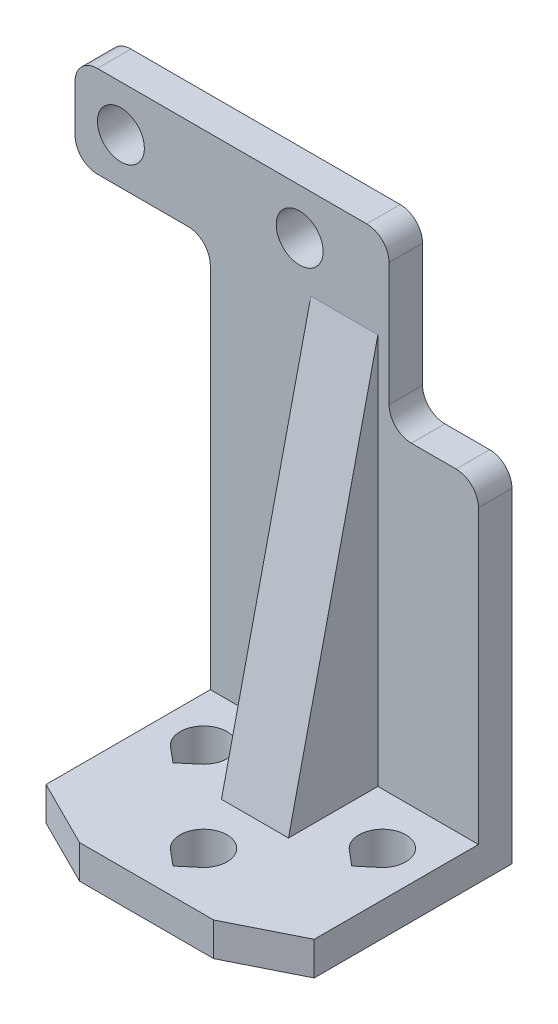
ISO-10303-21;
HEADER;
FILE_DESCRIPTION(('STEP AP214'),'2;1');
FILE_NAME('part.step','',(''),(''),'','','');
FILE_SCHEMA(('AUTOMOTIVE_DESIGN { 1 0 10303 214 1 1 1 1 }'));
ENDSEC;
DATA;
#1=APPLICATION_CONTEXT('core data for automotive mechanical design processes');
#2=APPLICATION_PROTOCOL_DEFINITION('international standard','automotive_design',2000,#1);
#3=PRODUCT_CONTEXT('',#1,'mechanical');
#4=PRODUCT('Part','Part','',(#3));
#5=PRODUCT_RELATED_PRODUCT_CATEGORY('part','',(#4));
#6=PRODUCT_DEFINITION_FORMATION('','',#4);
#7=PRODUCT_DEFINITION_CONTEXT('part definition',#1,'design');
#8=PRODUCT_DEFINITION('design','',#6,#7);
#9=PRODUCT_DEFINITION_SHAPE('','',#8);
#10=(LENGTH_UNIT() NAMED_UNIT(*) SI_UNIT(.MILLI.,.METRE.));
#11=(NAMED_UNIT(*) PLANE_ANGLE_UNIT() SI_UNIT($,.RADIAN.));
#12=(NAMED_UNIT(*) SI_UNIT($,.STERADIAN.) SOLID_ANGLE_UNIT());
#13=UNCERTAINTY_MEASURE_WITH_UNIT(LENGTH_MEASURE(1.E-05),#10,'distance_accuracy_value','');
#14=(GEOMETRIC_REPRESENTATION_CONTEXT(3) GLOBAL_UNCERTAINTY_ASSIGNED_CONTEXT((#13)) GLOBAL_UNIT_ASSIGNED_CONTEXT((#10,
#11,#12)) REPRESENTATION_CONTEXT('',''));
#15=CARTESIAN_POINT('',(0.,0.,0.));
#16=DIRECTION('',(0.,0.,1.));
#17=DIRECTION('',(1.,0.,0.));
#18=AXIS2_PLACEMENT_3D('',#15,#16,#17);
#19=CARTESIAN_POINT('',(0.,3.,0.));
#20=DIRECTION('',(0.,-1.,0.));
#21=DIRECTION('',(0.,0.,-1.));
#22=AXIS2_PLACEMENT_3D('',#19,#20,#21);
#23=PLANE('',#22);
#24=CARTESIAN_POINT('',(0.,3.,12.6));
#25=DIRECTION('',(0.,1.,0.));
#26=DIRECTION('',(0.,0.,1.));
#27=AXIS2_PLACEMENT_3D('',#24,#25,#26);
#28=CIRCLE('',#27,2.1);
#29=CARTESIAN_POINT('',(1.34985398034174,3.,14.2086933305499));
#30=VERTEX_POINT('',#29);
#31=CARTESIAN_POINT('',(-1.34985398034174,3.,14.2086933305499));
#32=VERTEX_POINT('',#31);
#33=EDGE_CURVE('E326',#30,#32,#28,.T.);
#34=ORIENTED_EDGE('',*,*,#33,.F.);
#35=DIRECTION('',(0.766044443118977,0.,-0.64278760968654));
#36=VECTOR('',#35,1.);
#37=CARTESIAN_POINT('',(0.,3.,15.3413553075978));
#38=LINE('',#37,#36);
#39=CARTESIAN_POINT('',(0.,3.,15.3413553075978));
#40=VERTEX_POINT('',#39);
#41=EDGE_CURVE('E332',#40,#30,#38,.T.);
#42=ORIENTED_EDGE('',*,*,#41,.F.);
#43=DIRECTION('',(0.766044443118976,0.,0.642787609686541));
#44=VECTOR('',#43,1.);
#45=CARTESIAN_POINT('',(-1.34985398034174,3.,14.2086933305499));
#46=LINE('',#45,#44);
#47=EDGE_CURVE('E328',#32,#40,#46,.T.);
#48=ORIENTED_EDGE('',*,*,#47,.F.);
#49=EDGE_LOOP('',(#34,#42,#48));
#50=FACE_BOUND('',#49,.T.);
#51=CARTESIAN_POINT('',(-8.,3.,4.6));
#52=DIRECTION('',(0.,1.,0.));
#53=DIRECTION('',(0.,0.,1.));
#54=AXIS2_PLACEMENT_3D('',#51,#52,#53);
#55=CIRCLE('',#54,2.1);
#56=CARTESIAN_POINT('',(-6.65014601965826,3.,6.20869333054985));
#57=VERTEX_POINT('',#56);
#58=CARTESIAN_POINT('',(-9.34985398034174,3.,6.20869333054985));
#59=VERTEX_POINT('',#58);
#60=EDGE_CURVE('E374',#57,#59,#55,.T.);
#61=ORIENTED_EDGE('',*,*,#60,.F.);
#62=DIRECTION('',(0.766044443118976,0.,-0.642787609686542));
#63=VECTOR('',#62,1.);
#64=CARTESIAN_POINT('',(-8.,3.,7.34135530759779));
#65=LINE('',#64,#63);
#66=CARTESIAN_POINT('',(-8.,3.,7.34135530759779));
#67=VERTEX_POINT('',#66);
#68=EDGE_CURVE('E380',#67,#57,#65,.T.);
#69=ORIENTED_EDGE('',*,*,#68,.F.);
#70=DIRECTION('',(0.766044443118977,0.,0.64278760968654));
#71=VECTOR('',#70,1.);
#72=CARTESIAN_POINT('',(-9.34985398034174,3.,6.20869333054985));
#73=LINE('',#72,#71);
#74=EDGE_CURVE('E376',#59,#67,#73,.T.);
#75=ORIENTED_EDGE('',*,*,#74,.F.);
#76=EDGE_LOOP('',(#61,#69,#75));
#77=FACE_BOUND('',#76,.T.);
#78=CARTESIAN_POINT('',(8.,3.,4.6));
#79=DIRECTION('',(0.,1.,0.));
#80=DIRECTION('',(0.,0.,1.));
#81=AXIS2_PLACEMENT_3D('',#78,#79,#80);
#82=CIRCLE('',#81,2.1);
#83=CARTESIAN_POINT('',(9.34985398034174,3.,6.20869333054985));
#84=VERTEX_POINT('',#83);
#85=CARTESIAN_POINT('',(6.65014601965826,3.,6.20869333054985));
#86=VERTEX_POINT('',#85);
#87=EDGE_CURVE('E350',#84,#86,#82,.T.);
#88=ORIENTED_EDGE('',*,*,#87,.F.);
#89=DIRECTION('',(0.766044443118976,0.,-0.642787609686542));
#90=VECTOR('',#89,1.);
#91=CARTESIAN_POINT('',(8.,3.,7.34135530759779));
#92=LINE('',#91,#90);
#93=CARTESIAN_POINT('',(8.,3.,7.34135530759779));
#94=VERTEX_POINT('',#93);
#95=EDGE_CURVE('E356',#94,#84,#92,.T.);
#96=ORIENTED_EDGE('',*,*,#95,.F.);
#97=DIRECTION('',(0.766044443118977,0.,0.642787609686541));
#98=VECTOR('',#97,1.);
#99=CARTESIAN_POINT('',(6.65014601965826,3.,6.20869333054985));
#100=LINE('',#99,#98);
#101=EDGE_CURVE('E352',#86,#94,#100,.T.);
#102=ORIENTED_EDGE('',*,*,#101,.F.);
#103=EDGE_LOOP('',(#88,#96,#102));
#104=FACE_BOUND('',#103,.T.);
#105=DIRECTION('',(0.,0.,1.));
#106=VECTOR('',#105,1.);
#107=CARTESIAN_POINT('',(-12.,3.,17.7));
#108=LINE('',#107,#106);
#109=CARTESIAN_POINT('',(-12.,3.,0.));
#110=VERTEX_POINT('',#109);
#111=CARTESIAN_POINT('',(-12.,3.,14.7));
#112=VERTEX_POINT('',#111);
#113=EDGE_CURVE('E401',#110,#112,#108,.T.);
#114=ORIENTED_EDGE('',*,*,#113,.T.);
#115=DIRECTION('',(-0.894427190999917,0.,-0.447213595499957));
#116=VECTOR('',#115,1.);
#117=CARTESIAN_POINT('',(-5.99999999999995,3.,17.7));
#118=LINE('',#117,#116);
#119=CARTESIAN_POINT('',(-5.99999999999996,3.,17.7));
#120=VERTEX_POINT('',#119);
#121=EDGE_CURVE('E428',#112,#120,#118,.F.);
#122=ORIENTED_EDGE('',*,*,#121,.T.);
#123=DIRECTION('',(1.,0.,0.));
#124=VECTOR('',#123,1.);
#125=CARTESIAN_POINT('',(-12.,3.,17.7));
#126=LINE('',#125,#124);
#127=CARTESIAN_POINT('',(5.99999999999996,3.,17.7));
#128=VERTEX_POINT('',#127);
#129=EDGE_CURVE('E403',#120,#128,#126,.T.);
#130=ORIENTED_EDGE('',*,*,#129,.T.);
#131=DIRECTION('',(-0.894427190999917,0.,0.447213595499956));
#132=VECTOR('',#131,1.);
#133=CARTESIAN_POINT('',(12.,3.,14.7));
#134=LINE('',#133,#132);
#135=CARTESIAN_POINT('',(12.,3.,14.7));
#136=VERTEX_POINT('',#135);
#137=EDGE_CURVE('E419',#128,#136,#134,.F.);
#138=ORIENTED_EDGE('',*,*,#137,.T.);
#139=DIRECTION('',(0.,0.,-1.));
#140=VECTOR('',#139,1.);
#141=CARTESIAN_POINT('',(12.,3.,17.7));
#142=LINE('',#141,#140);
#143=CARTESIAN_POINT('',(12.,3.,0.));
#144=VERTEX_POINT('',#143);
#145=EDGE_CURVE('E251',#136,#144,#142,.T.);
#146=ORIENTED_EDGE('',*,*,#145,.T.);
#147=DIRECTION('',(-1.,0.,0.));
#148=VECTOR('',#147,1.);
#149=CARTESIAN_POINT('',(-12.,3.,0.));
#150=LINE('',#149,#148);
#151=CARTESIAN_POINT('',(3.,3.,0.));
#152=VERTEX_POINT('',#151);
#153=EDGE_CURVE('E250',#144,#152,#150,.T.);
#154=ORIENTED_EDGE('',*,*,#153,.T.);
#155=DIRECTION('',(0.,0.,-1.));
#156=VECTOR('',#155,1.);
#157=CARTESIAN_POINT('',(3.,3.,0.));
#158=LINE('',#157,#156);
#159=CARTESIAN_POINT('',(3.,3.,8.));
#160=VERTEX_POINT('',#159);
#161=EDGE_CURVE('E267',#160,#152,#158,.T.);
#162=ORIENTED_EDGE('',*,*,#161,.F.);
#163=DIRECTION('',(-1.,0.,0.));
#164=VECTOR('',#163,1.);
#165=CARTESIAN_POINT('',(3.,3.,8.));
#166=LINE('',#165,#164);
#167=CARTESIAN_POINT('',(-3.,3.,8.));
#168=VERTEX_POINT('',#167);
#169=EDGE_CURVE('E256',#160,#168,#166,.T.);
#170=ORIENTED_EDGE('',*,*,#169,.T.);
#171=DIRECTION('',(0.,0.,-1.));
#172=VECTOR('',#171,1.);
#173=CARTESIAN_POINT('',(-3.,3.,0.));
#174=LINE('',#173,#172);
#175=CARTESIAN_POINT('',(-3.,3.,0.));
#176=VERTEX_POINT('',#175);
#177=EDGE_CURVE('E254',#168,#176,#174,.T.);
#178=ORIENTED_EDGE('',*,*,#177,.T.);
#179=EDGE_CURVE('E238',#176,#110,#150,.T.);
#180=ORIENTED_EDGE('',*,*,#179,.T.);
#181=EDGE_LOOP('',(#114,#122,#130,#138,#146,#154,#162,#170,#178,#180));
#182=FACE_BOUND('',#181,.T.);
#183=ADVANCED_FACE('F41',(#50,#77,#104,#182),#23,.F.);
#184=CARTESIAN_POINT('',(0.,0.,0.));
#185=DIRECTION('',(0.,0.,1.));
#186=DIRECTION('',(1.,0.,0.));
#187=AXIS2_PLACEMENT_3D('',#184,#185,#186);
#188=PLANE('',#187);
#189=CARTESIAN_POINT('',(-20.,42.,0.));
#190=DIRECTION('',(0.,0.,1.));
#191=DIRECTION('',(1.,0.,0.));
#192=AXIS2_PLACEMENT_3D('',#189,#190,#191);
#193=CIRCLE('',#192,2.1);
#194=CARTESIAN_POINT('',(-17.9,42.,0.));
#195=VERTEX_POINT('',#194);
#196=EDGE_CURVE('E277',#195,#195,#193,.T.);
#197=ORIENTED_EDGE('',*,*,#196,.F.);
#198=EDGE_LOOP('',(#197));
#199=FACE_BOUND('',#198,.T.);
#200=CARTESIAN_POINT('',(-4.,42.,0.));
#201=DIRECTION('',(0.,0.,1.));
#202=DIRECTION('',(1.,0.,0.));
#203=AXIS2_PLACEMENT_3D('',#200,#201,#202);
#204=CIRCLE('',#203,2.1);
#205=CARTESIAN_POINT('',(-1.9,42.,0.));
#206=VERTEX_POINT('',#205);
#207=EDGE_CURVE('E273',#206,#206,#204,.T.);
#208=ORIENTED_EDGE('',*,*,#207,.F.);
#209=EDGE_LOOP('',(#208));
#210=FACE_BOUND('',#209,.T.);
#211=DIRECTION('',(0.,1.,0.));
#212=VECTOR('',#211,1.);
#213=CARTESIAN_POINT('',(12.,0.,0.));
#214=LINE('',#213,#212);
#215=CARTESIAN_POINT('',(12.,29.1,0.));
#216=VERTEX_POINT('',#215);
#217=EDGE_CURVE('E283',#144,#216,#214,.T.);
#218=ORIENTED_EDGE('',*,*,#217,.T.);
#219=CARTESIAN_POINT('',(10.,29.1,0.));
#220=DIRECTION('',(0.,0.,1.));
#221=DIRECTION('',(1.,0.,0.));
#222=AXIS2_PLACEMENT_3D('',#219,#220,#221);
#223=CIRCLE('',#222,2.);
#224=CARTESIAN_POINT('',(10.,31.1,0.));
#225=VERTEX_POINT('',#224);
#226=EDGE_CURVE('E446',#216,#225,#223,.T.);
#227=ORIENTED_EDGE('',*,*,#226,.T.);
#228=DIRECTION('',(-1.,0.,0.));
#229=VECTOR('',#228,1.);
#230=CARTESIAN_POINT('',(12.,31.1,0.));
#231=LINE('',#230,#229);
#232=CARTESIAN_POINT('',(6.,31.1,0.));
#233=VERTEX_POINT('',#232);
#234=EDGE_CURVE('E310',#225,#233,#231,.T.);
#235=ORIENTED_EDGE('',*,*,#234,.T.);
#236=CARTESIAN_POINT('',(6.,33.1,0.));
#237=DIRECTION('',(0.,0.,1.));
#238=DIRECTION('',(1.,0.,0.));
#239=AXIS2_PLACEMENT_3D('',#236,#237,#238);
#240=CIRCLE('',#239,2.);
#241=CARTESIAN_POINT('',(4.,33.1,0.));
#242=VERTEX_POINT('',#241);
#243=EDGE_CURVE('E49',#233,#242,#240,.F.);
#244=ORIENTED_EDGE('',*,*,#243,.T.);
#245=DIRECTION('',(0.,1.,0.));
#246=VECTOR('',#245,1.);
#247=CARTESIAN_POINT('',(4.,31.1,0.));
#248=LINE('',#247,#246);
#249=CARTESIAN_POINT('',(4.,44.1,0.));
#250=VERTEX_POINT('',#249);
#251=EDGE_CURVE('E313',#242,#250,#248,.T.);
#252=ORIENTED_EDGE('',*,*,#251,.T.);
#253=CARTESIAN_POINT('',(2.,44.1,0.));
#254=DIRECTION('',(0.,0.,1.));
#255=DIRECTION('',(1.,0.,0.));
#256=AXIS2_PLACEMENT_3D('',#253,#254,#255);
#257=CIRCLE('',#256,2.);
#258=CARTESIAN_POINT('',(2.,46.1,0.));
#259=VERTEX_POINT('',#258);
#260=EDGE_CURVE('E444',#250,#259,#257,.T.);
#261=ORIENTED_EDGE('',*,*,#260,.T.);
#262=DIRECTION('',(-1.,0.,0.));
#263=VECTOR('',#262,1.);
#264=CARTESIAN_POINT('',(-12.,46.1,0.));
#265=LINE('',#264,#263);
#266=CARTESIAN_POINT('',(-22.1,46.1,0.));
#267=VERTEX_POINT('',#266);
#268=EDGE_CURVE('E316',#259,#267,#265,.T.);
#269=ORIENTED_EDGE('',*,*,#268,.T.);
#270=CARTESIAN_POINT('',(-22.1,44.1,0.));
#271=DIRECTION('',(0.,0.,1.));
#272=DIRECTION('',(1.,0.,0.));
#273=AXIS2_PLACEMENT_3D('',#270,#271,#272);
#274=CIRCLE('',#273,2.);
#275=CARTESIAN_POINT('',(-24.1,44.1,0.));
#276=VERTEX_POINT('',#275);
#277=EDGE_CURVE('E440',#267,#276,#274,.T.);
#278=ORIENTED_EDGE('',*,*,#277,.T.);
#279=DIRECTION('',(0.,-1.,0.));
#280=VECTOR('',#279,1.);
#281=CARTESIAN_POINT('',(-24.1,46.1,0.));
#282=LINE('',#281,#280);
#283=CARTESIAN_POINT('',(-24.1,39.9,0.));
#284=VERTEX_POINT('',#283);
#285=EDGE_CURVE('E319',#276,#284,#282,.T.);
#286=ORIENTED_EDGE('',*,*,#285,.T.);
#287=CARTESIAN_POINT('',(-22.1,39.9,0.));
#288=DIRECTION('',(0.,0.,1.));
#289=DIRECTION('',(1.,0.,0.));
#290=AXIS2_PLACEMENT_3D('',#287,#288,#289);
#291=CIRCLE('',#290,2.);
#292=CARTESIAN_POINT('',(-22.1,37.9,0.));
#293=VERTEX_POINT('',#292);
#294=EDGE_CURVE('E442',#284,#293,#291,.T.);
#295=ORIENTED_EDGE('',*,*,#294,.T.);
#296=DIRECTION('',(1.,0.,0.));
#297=VECTOR('',#296,1.);
#298=CARTESIAN_POINT('',(-12.,37.9,0.));
#299=LINE('',#298,#297);
#300=CARTESIAN_POINT('',(-14.,37.9,0.));
#301=VERTEX_POINT('',#300);
#302=EDGE_CURVE('E322',#293,#301,#299,.T.);
#303=ORIENTED_EDGE('',*,*,#302,.T.);
#304=CARTESIAN_POINT('',(-14.,35.9,0.));
#305=DIRECTION('',(0.,0.,1.));
#306=DIRECTION('',(1.,0.,0.));
#307=AXIS2_PLACEMENT_3D('',#304,#305,#306);
#308=CIRCLE('',#307,2.);
#309=CARTESIAN_POINT('',(-12.,35.9,0.));
#310=VERTEX_POINT('',#309);
#311=EDGE_CURVE('E474',#301,#310,#308,.F.);
#312=ORIENTED_EDGE('',*,*,#311,.T.);
#313=DIRECTION('',(0.,-1.,0.));
#314=VECTOR('',#313,1.);
#315=CARTESIAN_POINT('',(-12.,0.,0.));
#316=LINE('',#315,#314);
#317=EDGE_CURVE('E246',#310,#110,#316,.T.);
#318=ORIENTED_EDGE('',*,*,#317,.T.);
#319=ORIENTED_EDGE('',*,*,#179,.F.);
#320=DIRECTION('',(0.,1.,0.));
#321=VECTOR('',#320,1.);
#322=CARTESIAN_POINT('',(-3.,38.,0.));
#323=LINE('',#322,#321);
#324=CARTESIAN_POINT('',(-3.,38.,0.));
#325=VERTEX_POINT('',#324);
#326=EDGE_CURVE('E243',#176,#325,#323,.T.);
#327=ORIENTED_EDGE('',*,*,#326,.T.);
#328=DIRECTION('',(-1.,0.,0.));
#329=VECTOR('',#328,1.);
#330=CARTESIAN_POINT('',(3.,38.,0.));
#331=LINE('',#330,#329);
#332=CARTESIAN_POINT('',(3.,38.,0.));
#333=VERTEX_POINT('',#332);
#334=EDGE_CURVE('E271',#333,#325,#331,.T.);
#335=ORIENTED_EDGE('',*,*,#334,.F.);
#336=DIRECTION('',(0.,1.,0.));
#337=VECTOR('',#336,1.);
#338=CARTESIAN_POINT('',(3.,38.,0.));
#339=LINE('',#338,#337);
#340=EDGE_CURVE('E259',#152,#333,#339,.T.);
#341=ORIENTED_EDGE('',*,*,#340,.F.);
#342=ORIENTED_EDGE('',*,*,#153,.F.);
#343=EDGE_LOOP('',(#218,#227,#235,#244,#252,#261,#269,#278,#286,#295,#303,#312,#318,#319,#327,
#335,#341,#342));
#344=FACE_BOUND('',#343,.T.);
#345=ADVANCED_FACE('F241',(#199,#210,#344),#188,.T.);
#346=CARTESIAN_POINT('',(0.,0.,0.));
#347=DIRECTION('',(0.,-1.,0.));
#348=DIRECTION('',(0.,0.,-1.));
#349=AXIS2_PLACEMENT_3D('',#346,#347,#348);
#350=PLANE('',#349);
#351=DIRECTION('',(1.,0.,0.));
#352=VECTOR('',#351,1.);
#353=CARTESIAN_POINT('',(-12.,0.,17.7));
#354=LINE('',#353,#352);
#355=CARTESIAN_POINT('',(-5.99999999999996,0.,17.7));
#356=VERTEX_POINT('',#355);
#357=CARTESIAN_POINT('',(5.99999999999996,0.,17.7));
#358=VERTEX_POINT('',#357);
#359=EDGE_CURVE('E398',#356,#358,#354,.T.);
#360=ORIENTED_EDGE('',*,*,#359,.F.);
#361=DIRECTION('',(0.894427190999917,0.,0.447213595499957));
#362=VECTOR('',#361,1.);
#363=CARTESIAN_POINT('',(-8.27999999999997,0.,16.56));
#364=LINE('',#363,#362);
#365=CARTESIAN_POINT('',(-12.,0.,14.7));
#366=VERTEX_POINT('',#365);
#367=EDGE_CURVE('E424',#356,#366,#364,.F.);
#368=ORIENTED_EDGE('',*,*,#367,.T.);
#369=DIRECTION('',(0.,0.,1.));
#370=VECTOR('',#369,1.);
#371=CARTESIAN_POINT('',(-12.,0.,17.7));
#372=LINE('',#371,#370);
#373=CARTESIAN_POINT('',(-12.,0.,-3.));
#374=VERTEX_POINT('',#373);
#375=EDGE_CURVE('E407',#374,#366,#372,.T.);
#376=ORIENTED_EDGE('',*,*,#375,.F.);
#377=DIRECTION('',(1.,0.,0.));
#378=VECTOR('',#377,1.);
#379=CARTESIAN_POINT('',(12.,0.,-3.));
#380=LINE('',#379,#378);
#381=CARTESIAN_POINT('',(12.,0.,-3.));
#382=VERTEX_POINT('',#381);
#383=EDGE_CURVE('E305',#374,#382,#380,.T.);
#384=ORIENTED_EDGE('',*,*,#383,.T.);
#385=DIRECTION('',(0.,0.,-1.));
#386=VECTOR('',#385,1.);
#387=CARTESIAN_POINT('',(12.,0.,17.7));
#388=LINE('',#387,#386);
#389=CARTESIAN_POINT('',(12.,0.,14.7));
#390=VERTEX_POINT('',#389);
#391=EDGE_CURVE('E397',#390,#382,#388,.T.);
#392=ORIENTED_EDGE('',*,*,#391,.F.);
#393=DIRECTION('',(0.894427190999917,0.,-0.447213595499956));
#394=VECTOR('',#393,1.);
#395=CARTESIAN_POINT('',(8.27999999999996,0.,16.56));
#396=LINE('',#395,#394);
#397=EDGE_CURVE('E413',#390,#358,#396,.F.);
#398=ORIENTED_EDGE('',*,*,#397,.T.);
#399=EDGE_LOOP('',(#360,#368,#376,#384,#392,#398));
#400=FACE_BOUND('',#399,.T.);
#401=DIRECTION('',(0.766044443118976,0.,-0.642787609686542));
#402=VECTOR('',#401,1.);
#403=CARTESIAN_POINT('',(-8.,0.,7.34135530759779));
#404=LINE('',#403,#402);
#405=CARTESIAN_POINT('',(-8.,0.,7.34135530759779));
#406=VERTEX_POINT('',#405);
#407=CARTESIAN_POINT('',(-6.65014601965826,0.,6.20869333054985));
#408=VERTEX_POINT('',#407);
#409=EDGE_CURVE('E377',#406,#408,#404,.T.);
#410=ORIENTED_EDGE('',*,*,#409,.T.);
#411=CARTESIAN_POINT('',(-8.,0.,4.6));
#412=DIRECTION('',(0.,1.,0.));
#413=DIRECTION('',(0.,0.,1.));
#414=AXIS2_PLACEMENT_3D('',#411,#412,#413);
#415=CIRCLE('',#414,2.1);
#416=CARTESIAN_POINT('',(-9.34985398034174,0.,6.20869333054985));
#417=VERTEX_POINT('',#416);
#418=EDGE_CURVE('E373',#408,#417,#415,.T.);
#419=ORIENTED_EDGE('',*,*,#418,.T.);
#420=DIRECTION('',(0.766044443118977,0.,0.64278760968654));
#421=VECTOR('',#420,1.);
#422=CARTESIAN_POINT('',(-9.34985398034174,0.,6.20869333054985));
#423=LINE('',#422,#421);
#424=EDGE_CURVE('E385',#417,#406,#423,.T.);
#425=ORIENTED_EDGE('',*,*,#424,.T.);
#426=EDGE_LOOP('',(#410,#419,#425));
#427=FACE_BOUND('',#426,.T.);
#428=DIRECTION('',(0.766044443118976,0.,-0.642787609686542));
#429=VECTOR('',#428,1.);
#430=CARTESIAN_POINT('',(8.,0.,7.34135530759779));
#431=LINE('',#430,#429);
#432=CARTESIAN_POINT('',(8.,0.,7.34135530759779));
#433=VERTEX_POINT('',#432);
#434=CARTESIAN_POINT('',(9.34985398034174,0.,6.20869333054985));
#435=VERTEX_POINT('',#434);
#436=EDGE_CURVE('E353',#433,#435,#431,.T.);
#437=ORIENTED_EDGE('',*,*,#436,.T.);
#438=CARTESIAN_POINT('',(8.,0.,4.6));
#439=DIRECTION('',(0.,1.,0.));
#440=DIRECTION('',(0.,0.,1.));
#441=AXIS2_PLACEMENT_3D('',#438,#439,#440);
#442=CIRCLE('',#441,2.1);
#443=CARTESIAN_POINT('',(6.65014601965826,0.,6.20869333054985));
#444=VERTEX_POINT('',#443);
#445=EDGE_CURVE('E349',#435,#444,#442,.T.);
#446=ORIENTED_EDGE('',*,*,#445,.T.);
#447=DIRECTION('',(0.766044443118977,0.,0.642787609686541));
#448=VECTOR('',#447,1.);
#449=CARTESIAN_POINT('',(6.65014601965826,0.,6.20869333054985));
#450=LINE('',#449,#448);
#451=EDGE_CURVE('E361',#444,#433,#450,.T.);
#452=ORIENTED_EDGE('',*,*,#451,.T.);
#453=EDGE_LOOP('',(#437,#446,#452));
#454=FACE_BOUND('',#453,.T.);
#455=DIRECTION('',(0.766044443118977,0.,-0.64278760968654));
#456=VECTOR('',#455,1.);
#457=CARTESIAN_POINT('',(0.,0.,15.3413553075978));
#458=LINE('',#457,#456);
#459=CARTESIAN_POINT('',(0.,0.,15.3413553075978));
#460=VERTEX_POINT('',#459);
#461=CARTESIAN_POINT('',(1.34985398034174,0.,14.2086933305499));
#462=VERTEX_POINT('',#461);
#463=EDGE_CURVE('E329',#460,#462,#458,.T.);
#464=ORIENTED_EDGE('',*,*,#463,.T.);
#465=CARTESIAN_POINT('',(0.,0.,12.6));
#466=DIRECTION('',(0.,1.,0.));
#467=DIRECTION('',(0.,0.,1.));
#468=AXIS2_PLACEMENT_3D('',#465,#466,#467);
#469=CIRCLE('',#468,2.1);
#470=CARTESIAN_POINT('',(-1.34985398034174,0.,14.2086933305499));
#471=VERTEX_POINT('',#470);
#472=EDGE_CURVE('E308',#462,#471,#469,.T.);
#473=ORIENTED_EDGE('',*,*,#472,.T.);
#474=DIRECTION('',(0.766044443118976,0.,0.642787609686541));
#475=VECTOR('',#474,1.);
#476=CARTESIAN_POINT('',(-1.34985398034174,0.,14.2086933305499));
#477=LINE('',#476,#475);
#478=EDGE_CURVE('E337',#471,#460,#477,.T.);
#479=ORIENTED_EDGE('',*,*,#478,.T.);
#480=EDGE_LOOP('',(#464,#473,#479));
#481=FACE_BOUND('',#480,.T.);
#482=ADVANCED_FACE('F503',(#400,#427,#454,#481),#350,.T.);
#483=CARTESIAN_POINT('',(12.,3.,17.7));
#484=DIRECTION('',(-1.,0.,0.));
#485=DIRECTION('',(0.,0.,1.));
#486=AXIS2_PLACEMENT_3D('',#483,#484,#485);
#487=PLANE('',#486);
#488=DIRECTION('',(0.,1.,0.));
#489=VECTOR('',#488,1.);
#490=CARTESIAN_POINT('',(12.,0.,-3.));
#491=LINE('',#490,#489);
#492=CARTESIAN_POINT('',(12.,29.1,-3.));
#493=VERTEX_POINT('',#492);
#494=EDGE_CURVE('E286',#382,#493,#491,.T.);
#495=ORIENTED_EDGE('',*,*,#494,.T.);
#496=DIRECTION('',(0.,0.,1.));
#497=VECTOR('',#496,1.);
#498=CARTESIAN_POINT('',(12.,29.1,0.));
#499=LINE('',#498,#497);
#500=EDGE_CURVE('E437',#493,#216,#499,.T.);
#501=ORIENTED_EDGE('',*,*,#500,.T.);
#502=ORIENTED_EDGE('',*,*,#217,.F.);
#503=ORIENTED_EDGE('',*,*,#145,.F.);
#504=DIRECTION('',(0.,-1.,0.));
#505=VECTOR('',#504,1.);
#506=CARTESIAN_POINT('',(12.,3.,14.7));
#507=LINE('',#506,#505);
#508=EDGE_CURVE('E405',#136,#390,#507,.T.);
#509=ORIENTED_EDGE('',*,*,#508,.T.);
#510=ORIENTED_EDGE('',*,*,#391,.T.);
#511=EDGE_LOOP('',(#495,#501,#502,#503,#509,#510));
#512=FACE_BOUND('',#511,.T.);
#513=ADVANCED_FACE('F496',(#512),#487,.F.);
#514=CARTESIAN_POINT('',(-12.,3.,17.7));
#515=DIRECTION('',(1.,0.,0.));
#516=DIRECTION('',(0.,0.,-1.));
#517=AXIS2_PLACEMENT_3D('',#514,#515,#516);
#518=PLANE('',#517);
#519=ORIENTED_EDGE('',*,*,#317,.F.);
#520=DIRECTION('',(0.,0.,1.));
#521=VECTOR('',#520,1.);
#522=CARTESIAN_POINT('',(-12.,35.9,17.7));
#523=LINE('',#522,#521);
#524=CARTESIAN_POINT('',(-12.,35.9,-3.));
#525=VERTEX_POINT('',#524);
#526=EDGE_CURVE('E435',#310,#525,#523,.F.);
#527=ORIENTED_EDGE('',*,*,#526,.T.);
#528=DIRECTION('',(0.,-1.,0.));
#529=VECTOR('',#528,1.);
#530=CARTESIAN_POINT('',(-12.,0.,-3.));
#531=LINE('',#530,#529);
#532=EDGE_CURVE('E303',#525,#374,#531,.T.);
#533=ORIENTED_EDGE('',*,*,#532,.T.);
#534=ORIENTED_EDGE('',*,*,#375,.T.);
#535=DIRECTION('',(0.,1.,0.));
#536=VECTOR('',#535,1.);
#537=CARTESIAN_POINT('',(-12.,3.,14.7));
#538=LINE('',#537,#536);
#539=EDGE_CURVE('E426',#366,#112,#538,.T.);
#540=ORIENTED_EDGE('',*,*,#539,.T.);
#541=ORIENTED_EDGE('',*,*,#113,.F.);
#542=EDGE_LOOP('',(#519,#527,#533,#534,#540,#541));
#543=FACE_BOUND('',#542,.T.);
#544=ADVANCED_FACE('F563',(#543),#518,.F.);
#545=CARTESIAN_POINT('',(-12.,3.,17.7));
#546=DIRECTION('',(0.,0.,-1.));
#547=DIRECTION('',(-1.,0.,0.));
#548=AXIS2_PLACEMENT_3D('',#545,#546,#547);
#549=PLANE('',#548);
#550=ORIENTED_EDGE('',*,*,#129,.F.);
#551=DIRECTION('',(0.,-1.,0.));
#552=VECTOR('',#551,1.);
#553=CARTESIAN_POINT('',(-5.99999999999996,3.,17.7));
#554=LINE('',#553,#552);
#555=EDGE_CURVE('E421',#120,#356,#554,.T.);
#556=ORIENTED_EDGE('',*,*,#555,.T.);
#557=ORIENTED_EDGE('',*,*,#359,.T.);
#558=DIRECTION('',(0.,1.,0.));
#559=VECTOR('',#558,1.);
#560=CARTESIAN_POINT('',(5.99999999999996,3.,17.7));
#561=LINE('',#560,#559);
#562=EDGE_CURVE('E416',#358,#128,#561,.T.);
#563=ORIENTED_EDGE('',*,*,#562,.T.);
#564=EDGE_LOOP('',(#550,#556,#557,#563));
#565=FACE_BOUND('',#564,.T.);
#566=ADVANCED_FACE('F560',(#565),#549,.F.);
#567=CARTESIAN_POINT('',(-8.,3.,4.6));
#568=DIRECTION('',(0.,-1.,0.));
#569=DIRECTION('',(0.,0.,-1.));
#570=AXIS2_PLACEMENT_3D('',#567,#568,#569);
#571=CYLINDRICAL_SURFACE('',#570,2.1);
#572=ORIENTED_EDGE('',*,*,#418,.F.);
#573=DIRECTION('',(0.,-1.,0.));
#574=VECTOR('',#573,1.);
#575=CARTESIAN_POINT('',(-6.65014601965826,3.,6.20869333054985));
#576=LINE('',#575,#574);
#577=EDGE_CURVE('E382',#57,#408,#576,.T.);
#578=ORIENTED_EDGE('',*,*,#577,.F.);
#579=ORIENTED_EDGE('',*,*,#60,.T.);
#580=DIRECTION('',(0.,-1.,0.));
#581=VECTOR('',#580,1.);
#582=CARTESIAN_POINT('',(-9.34985398034174,3.,6.20869333054985));
#583=LINE('',#582,#581);
#584=EDGE_CURVE('E394',#59,#417,#583,.T.);
#585=ORIENTED_EDGE('',*,*,#584,.T.);
#586=EDGE_LOOP('',(#572,#578,#579,#585));
#587=FACE_BOUND('',#586,.T.);
#588=ADVANCED_FACE('F556',(#587),#571,.F.);
#589=CARTESIAN_POINT('',(-9.34985398034174,3.,6.20869333054985));
#590=DIRECTION('',(0.64278760968654,0.,-0.766044443118978));
#591=DIRECTION('',(-0.766044443118978,0.,-0.64278760968654));
#592=AXIS2_PLACEMENT_3D('',#589,#590,#591);
#593=PLANE('',#592);
#594=ORIENTED_EDGE('',*,*,#424,.F.);
#595=ORIENTED_EDGE('',*,*,#584,.F.);
#596=ORIENTED_EDGE('',*,*,#74,.T.);
#597=DIRECTION('',(0.,-1.,0.));
#598=VECTOR('',#597,1.);
#599=CARTESIAN_POINT('',(-8.,3.,7.34135530759779));
#600=LINE('',#599,#598);
#601=EDGE_CURVE('E392',#67,#406,#600,.T.);
#602=ORIENTED_EDGE('',*,*,#601,.T.);
#603=EDGE_LOOP('',(#594,#595,#596,#602));
#604=FACE_BOUND('',#603,.T.);
#605=ADVANCED_FACE('F769',(#604),#593,.T.);
#606=CARTESIAN_POINT('',(-8.,3.,7.34135530759779));
#607=DIRECTION('',(-0.642787609686542,0.,-0.766044443118976));
#608=DIRECTION('',(-0.766044443118976,0.,0.642787609686542));
#609=AXIS2_PLACEMENT_3D('',#606,#607,#608);
#610=PLANE('',#609);
#611=ORIENTED_EDGE('',*,*,#409,.F.);
#612=ORIENTED_EDGE('',*,*,#601,.F.);
#613=ORIENTED_EDGE('',*,*,#68,.T.);
#614=ORIENTED_EDGE('',*,*,#577,.T.);
#615=EDGE_LOOP('',(#611,#612,#613,#614));
#616=FACE_BOUND('',#615,.T.);
#617=ADVANCED_FACE('F775',(#616),#610,.T.);
#618=CARTESIAN_POINT('',(8.,3.,4.6));
#619=DIRECTION('',(0.,-1.,0.));
#620=DIRECTION('',(0.,0.,-1.));
#621=AXIS2_PLACEMENT_3D('',#618,#619,#620);
#622=CYLINDRICAL_SURFACE('',#621,2.1);
#623=ORIENTED_EDGE('',*,*,#445,.F.);
#624=DIRECTION('',(0.,-1.,0.));
#625=VECTOR('',#624,1.);
#626=CARTESIAN_POINT('',(9.34985398034174,3.,6.20869333054985));
#627=LINE('',#626,#625);
#628=EDGE_CURVE('E358',#84,#435,#627,.T.);
#629=ORIENTED_EDGE('',*,*,#628,.F.);
#630=ORIENTED_EDGE('',*,*,#87,.T.);
#631=DIRECTION('',(0.,-1.,0.));
#632=VECTOR('',#631,1.);
#633=CARTESIAN_POINT('',(6.65014601965826,3.,6.20869333054985));
#634=LINE('',#633,#632);
#635=EDGE_CURVE('E370',#86,#444,#634,.T.);
#636=ORIENTED_EDGE('',*,*,#635,.T.);
#637=EDGE_LOOP('',(#623,#629,#630,#636));
#638=FACE_BOUND('',#637,.T.);
#639=ADVANCED_FACE('F782',(#638),#622,.F.);
#640=CARTESIAN_POINT('',(6.65014601965826,3.,6.20869333054985));
#641=DIRECTION('',(0.642787609686541,0.,-0.766044443118977));
#642=DIRECTION('',(-0.766044443118977,0.,-0.642787609686541));
#643=AXIS2_PLACEMENT_3D('',#640,#641,#642);
#644=PLANE('',#643);
#645=ORIENTED_EDGE('',*,*,#451,.F.);
#646=ORIENTED_EDGE('',*,*,#635,.F.);
#647=ORIENTED_EDGE('',*,*,#101,.T.);
#648=DIRECTION('',(0.,-1.,0.));
#649=VECTOR('',#648,1.);
#650=CARTESIAN_POINT('',(8.,3.,7.34135530759779));
#651=LINE('',#650,#649);
#652=EDGE_CURVE('E368',#94,#433,#651,.T.);
#653=ORIENTED_EDGE('',*,*,#652,.T.);
#654=EDGE_LOOP('',(#645,#646,#647,#653));
#655=FACE_BOUND('',#654,.T.);
#656=ADVANCED_FACE('F790',(#655),#644,.T.);
#657=CARTESIAN_POINT('',(8.,3.,7.34135530759779));
#658=DIRECTION('',(-0.642787609686542,0.,-0.766044443118976));
#659=DIRECTION('',(-0.766044443118976,0.,0.642787609686542));
#660=AXIS2_PLACEMENT_3D('',#657,#658,#659);
#661=PLANE('',#660);
#662=ORIENTED_EDGE('',*,*,#436,.F.);
#663=ORIENTED_EDGE('',*,*,#652,.F.);
#664=ORIENTED_EDGE('',*,*,#95,.T.);
#665=ORIENTED_EDGE('',*,*,#628,.T.);
#666=EDGE_LOOP('',(#662,#663,#664,#665));
#667=FACE_BOUND('',#666,.T.);
#668=ADVANCED_FACE('F798',(#667),#661,.T.);
#669=CARTESIAN_POINT('',(0.,3.,12.6));
#670=DIRECTION('',(0.,-1.,0.));
#671=DIRECTION('',(0.,0.,-1.));
#672=AXIS2_PLACEMENT_3D('',#669,#670,#671);
#673=CYLINDRICAL_SURFACE('',#672,2.1);
#674=ORIENTED_EDGE('',*,*,#472,.F.);
#675=DIRECTION('',(0.,-1.,0.));
#676=VECTOR('',#675,1.);
#677=CARTESIAN_POINT('',(1.34985398034174,3.,14.2086933305499));
#678=LINE('',#677,#676);
#679=EDGE_CURVE('E334',#30,#462,#678,.T.);
#680=ORIENTED_EDGE('',*,*,#679,.F.);
#681=ORIENTED_EDGE('',*,*,#33,.T.);
#682=DIRECTION('',(0.,-1.,0.));
#683=VECTOR('',#682,1.);
#684=CARTESIAN_POINT('',(-1.34985398034174,3.,14.2086933305499));
#685=LINE('',#684,#683);
#686=EDGE_CURVE('E346',#32,#471,#685,.T.);
#687=ORIENTED_EDGE('',*,*,#686,.T.);
#688=EDGE_LOOP('',(#674,#680,#681,#687));
#689=FACE_BOUND('',#688,.T.);
#690=ADVANCED_FACE('F806',(#689),#673,.F.);
#691=CARTESIAN_POINT('',(-1.34985398034174,3.,14.2086933305499));
#692=DIRECTION('',(0.642787609686541,0.,-0.766044443118976));
#693=DIRECTION('',(-0.766044443118976,0.,-0.642787609686541));
#694=AXIS2_PLACEMENT_3D('',#691,#692,#693);
#695=PLANE('',#694);
#696=ORIENTED_EDGE('',*,*,#478,.F.);
#697=ORIENTED_EDGE('',*,*,#686,.F.);
#698=ORIENTED_EDGE('',*,*,#47,.T.);
#699=DIRECTION('',(0.,-1.,0.));
#700=VECTOR('',#699,1.);
#701=CARTESIAN_POINT('',(0.,3.,15.3413553075978));
#702=LINE('',#701,#700);
#703=EDGE_CURVE('E344',#40,#460,#702,.T.);
#704=ORIENTED_EDGE('',*,*,#703,.T.);
#705=EDGE_LOOP('',(#696,#697,#698,#704));
#706=FACE_BOUND('',#705,.T.);
#707=ADVANCED_FACE('F814',(#706),#695,.T.);
#708=CARTESIAN_POINT('',(0.,3.,15.3413553075978));
#709=DIRECTION('',(-0.642787609686541,0.,-0.766044443118977));
#710=DIRECTION('',(-0.766044443118977,0.,0.642787609686541));
#711=AXIS2_PLACEMENT_3D('',#708,#709,#710);
#712=PLANE('',#711);
#713=ORIENTED_EDGE('',*,*,#463,.F.);
#714=ORIENTED_EDGE('',*,*,#703,.F.);
#715=ORIENTED_EDGE('',*,*,#41,.T.);
#716=ORIENTED_EDGE('',*,*,#679,.T.);
#717=EDGE_LOOP('',(#713,#714,#715,#716));
#718=FACE_BOUND('',#717,.T.);
#719=ADVANCED_FACE('F733',(#718),#712,.T.);
#720=CARTESIAN_POINT('',(-12.,37.9,-3.));
#721=DIRECTION('',(0.,-1.,0.));
#722=DIRECTION('',(0.,0.,-1.));
#723=AXIS2_PLACEMENT_3D('',#720,#721,#722);
#724=PLANE('',#723);
#725=DIRECTION('',(1.,0.,0.));
#726=VECTOR('',#725,1.);
#727=CARTESIAN_POINT('',(-12.,37.9,-3.));
#728=LINE('',#727,#726);
#729=CARTESIAN_POINT('',(-22.1,37.9,-3.));
#730=VERTEX_POINT('',#729);
#731=CARTESIAN_POINT('',(-14.,37.9,-3.));
#732=VERTEX_POINT('',#731);
#733=EDGE_CURVE('E300',#730,#732,#728,.T.);
#734=ORIENTED_EDGE('',*,*,#733,.T.);
#735=DIRECTION('',(0.,0.,1.));
#736=VECTOR('',#735,1.);
#737=CARTESIAN_POINT('',(-14.,37.9,-3.));
#738=LINE('',#737,#736);
#739=EDGE_CURVE('E432',#732,#301,#738,.T.);
#740=ORIENTED_EDGE('',*,*,#739,.T.);
#741=ORIENTED_EDGE('',*,*,#302,.F.);
#742=DIRECTION('',(0.,0.,1.));
#743=VECTOR('',#742,1.);
#744=CARTESIAN_POINT('',(-22.1,37.9,-3.));
#745=LINE('',#744,#743);
#746=EDGE_CURVE('E430',#293,#730,#745,.F.);
#747=ORIENTED_EDGE('',*,*,#746,.T.);
#748=EDGE_LOOP('',(#734,#740,#741,#747));
#749=FACE_BOUND('',#748,.T.);
#750=ADVANCED_FACE('F517',(#749),#724,.T.);
#751=CARTESIAN_POINT('',(-24.1,46.1,-3.));
#752=DIRECTION('',(-1.,0.,0.));
#753=DIRECTION('',(0.,0.,1.));
#754=AXIS2_PLACEMENT_3D('',#751,#752,#753);
#755=PLANE('',#754);
#756=DIRECTION('',(0.,-1.,0.));
#757=VECTOR('',#756,1.);
#758=CARTESIAN_POINT('',(-24.1,46.1,-3.));
#759=LINE('',#758,#757);
#760=CARTESIAN_POINT('',(-24.1,44.1,-3.));
#761=VERTEX_POINT('',#760);
#762=CARTESIAN_POINT('',(-24.1,39.9,-3.));
#763=VERTEX_POINT('',#762);
#764=EDGE_CURVE('E297',#761,#763,#759,.T.);
#765=ORIENTED_EDGE('',*,*,#764,.T.);
#766=DIRECTION('',(0.,0.,1.));
#767=VECTOR('',#766,1.);
#768=CARTESIAN_POINT('',(-24.1,39.9,-3.));
#769=LINE('',#768,#767);
#770=EDGE_CURVE('E471',#763,#284,#769,.T.);
#771=ORIENTED_EDGE('',*,*,#770,.T.);
#772=ORIENTED_EDGE('',*,*,#285,.F.);
#773=DIRECTION('',(0.,0.,1.));
#774=VECTOR('',#773,1.);
#775=CARTESIAN_POINT('',(-24.1,44.1,-3.));
#776=LINE('',#775,#774);
#777=EDGE_CURVE('E469',#276,#761,#776,.F.);
#778=ORIENTED_EDGE('',*,*,#777,.T.);
#779=EDGE_LOOP('',(#765,#771,#772,#778));
#780=FACE_BOUND('',#779,.T.);
#781=ADVANCED_FACE('F525',(#780),#755,.T.);
#782=CARTESIAN_POINT('',(-12.,46.1,-3.));
#783=DIRECTION('',(0.,1.,0.));
#784=DIRECTION('',(0.,0.,1.));
#785=AXIS2_PLACEMENT_3D('',#782,#783,#784);
#786=PLANE('',#785);
#787=ORIENTED_EDGE('',*,*,#268,.F.);
#788=DIRECTION('',(0.,0.,1.));
#789=VECTOR('',#788,1.);
#790=CARTESIAN_POINT('',(2.,46.1,-3.));
#791=LINE('',#790,#789);
#792=CARTESIAN_POINT('',(2.,46.1,-3.));
#793=VERTEX_POINT('',#792);
#794=EDGE_CURVE('E467',#259,#793,#791,.F.);
#795=ORIENTED_EDGE('',*,*,#794,.T.);
#796=DIRECTION('',(-1.,0.,0.));
#797=VECTOR('',#796,1.);
#798=CARTESIAN_POINT('',(4.,46.1,-3.));
#799=LINE('',#798,#797);
#800=CARTESIAN_POINT('',(-22.1,46.1,-3.));
#801=VERTEX_POINT('',#800);
#802=EDGE_CURVE('E294',#793,#801,#799,.T.);
#803=ORIENTED_EDGE('',*,*,#802,.T.);
#804=DIRECTION('',(0.,0.,1.));
#805=VECTOR('',#804,1.);
#806=CARTESIAN_POINT('',(-22.1,46.1,-3.));
#807=LINE('',#806,#805);
#808=EDGE_CURVE('E464',#801,#267,#807,.T.);
#809=ORIENTED_EDGE('',*,*,#808,.T.);
#810=EDGE_LOOP('',(#787,#795,#803,#809));
#811=FACE_BOUND('',#810,.T.);
#812=ADVANCED_FACE('F533',(#811),#786,.T.);
#813=CARTESIAN_POINT('',(4.,31.1,-3.));
#814=DIRECTION('',(1.,0.,0.));
#815=DIRECTION('',(0.,0.,-1.));
#816=AXIS2_PLACEMENT_3D('',#813,#814,#815);
#817=PLANE('',#816);
#818=ORIENTED_EDGE('',*,*,#251,.F.);
#819=DIRECTION('',(0.,0.,1.));
#820=VECTOR('',#819,1.);
#821=CARTESIAN_POINT('',(4.,33.1,-3.));
#822=LINE('',#821,#820);
#823=CARTESIAN_POINT('',(4.,33.1,-3.));
#824=VERTEX_POINT('',#823);
#825=EDGE_CURVE('E63',#242,#824,#822,.F.);
#826=ORIENTED_EDGE('',*,*,#825,.T.);
#827=DIRECTION('',(0.,1.,0.));
#828=VECTOR('',#827,1.);
#829=CARTESIAN_POINT('',(4.,31.1,-3.));
#830=LINE('',#829,#828);
#831=CARTESIAN_POINT('',(4.,44.1,-3.));
#832=VERTEX_POINT('',#831);
#833=EDGE_CURVE('E292',#824,#832,#830,.T.);
#834=ORIENTED_EDGE('',*,*,#833,.T.);
#835=DIRECTION('',(0.,0.,1.));
#836=VECTOR('',#835,1.);
#837=CARTESIAN_POINT('',(4.,44.1,-3.));
#838=LINE('',#837,#836);
#839=EDGE_CURVE('E460',#832,#250,#838,.T.);
#840=ORIENTED_EDGE('',*,*,#839,.T.);
#841=EDGE_LOOP('',(#818,#826,#834,#840));
#842=FACE_BOUND('',#841,.T.);
#843=ADVANCED_FACE('F480',(#842),#817,.T.);
#844=CARTESIAN_POINT('',(12.,31.1,-3.));
#845=DIRECTION('',(0.,1.,0.));
#846=DIRECTION('',(0.,0.,1.));
#847=AXIS2_PLACEMENT_3D('',#844,#845,#846);
#848=PLANE('',#847);
#849=ORIENTED_EDGE('',*,*,#234,.F.);
#850=DIRECTION('',(0.,0.,1.));
#851=VECTOR('',#850,1.);
#852=CARTESIAN_POINT('',(10.,31.1,-3.));
#853=LINE('',#852,#851);
#854=CARTESIAN_POINT('',(10.,31.1,-3.));
#855=VERTEX_POINT('',#854);
#856=EDGE_CURVE('E451',#225,#855,#853,.F.);
#857=ORIENTED_EDGE('',*,*,#856,.T.);
#858=DIRECTION('',(-1.,0.,0.));
#859=VECTOR('',#858,1.);
#860=CARTESIAN_POINT('',(12.,31.1,-3.));
#861=LINE('',#860,#859);
#862=CARTESIAN_POINT('',(6.,31.1,-3.));
#863=VERTEX_POINT('',#862);
#864=EDGE_CURVE('E289',#855,#863,#861,.T.);
#865=ORIENTED_EDGE('',*,*,#864,.T.);
#866=DIRECTION('',(0.,0.,1.));
#867=VECTOR('',#866,1.);
#868=CARTESIAN_POINT('',(6.,31.1,0.));
#869=LINE('',#868,#867);
#870=EDGE_CURVE('E448',#863,#233,#869,.T.);
#871=ORIENTED_EDGE('',*,*,#870,.T.);
#872=EDGE_LOOP('',(#849,#857,#865,#871));
#873=FACE_BOUND('',#872,.T.);
#874=ADVANCED_FACE('F488',(#873),#848,.T.);
#875=CARTESIAN_POINT('',(0.,0.,-3.));
#876=DIRECTION('',(0.,0.,1.));
#877=DIRECTION('',(1.,0.,0.));
#878=AXIS2_PLACEMENT_3D('',#875,#876,#877);
#879=PLANE('',#878);
#880=CARTESIAN_POINT('',(-4.,42.,-3.));
#881=DIRECTION('',(0.,0.,1.));
#882=DIRECTION('',(1.,0.,0.));
#883=AXIS2_PLACEMENT_3D('',#880,#881,#882);
#884=CIRCLE('',#883,2.1);
#885=CARTESIAN_POINT('',(-1.9,42.,-3.));
#886=VERTEX_POINT('',#885);
#887=EDGE_CURVE('E274',#886,#886,#884,.T.);
#888=ORIENTED_EDGE('',*,*,#887,.T.);
#889=EDGE_LOOP('',(#888));
#890=FACE_BOUND('',#889,.T.);
#891=CARTESIAN_POINT('',(-20.,42.,-3.));
#892=DIRECTION('',(0.,0.,1.));
#893=DIRECTION('',(1.,0.,0.));
#894=AXIS2_PLACEMENT_3D('',#891,#892,#893);
#895=CIRCLE('',#894,2.1);
#896=CARTESIAN_POINT('',(-17.9,42.,-3.));
#897=VERTEX_POINT('',#896);
#898=EDGE_CURVE('E280',#897,#897,#895,.T.);
#899=ORIENTED_EDGE('',*,*,#898,.T.);
#900=EDGE_LOOP('',(#899));
#901=FACE_BOUND('',#900,.T.);
#902=ORIENTED_EDGE('',*,*,#864,.F.);
#903=CARTESIAN_POINT('',(10.,29.1,-3.));
#904=DIRECTION('',(0.,0.,1.));
#905=DIRECTION('',(1.,0.,0.));
#906=AXIS2_PLACEMENT_3D('',#903,#904,#905);
#907=CIRCLE('',#906,2.);
#908=EDGE_CURVE('E458',#855,#493,#907,.F.);
#909=ORIENTED_EDGE('',*,*,#908,.T.);
#910=ORIENTED_EDGE('',*,*,#494,.F.);
#911=ORIENTED_EDGE('',*,*,#383,.F.);
#912=ORIENTED_EDGE('',*,*,#532,.F.);
#913=CARTESIAN_POINT('',(-14.,35.9,-3.));
#914=DIRECTION('',(0.,0.,1.));
#915=DIRECTION('',(1.,0.,0.));
#916=AXIS2_PLACEMENT_3D('',#913,#914,#915);
#917=CIRCLE('',#916,2.);
#918=EDGE_CURVE('E476',#525,#732,#917,.T.);
#919=ORIENTED_EDGE('',*,*,#918,.T.);
#920=ORIENTED_EDGE('',*,*,#733,.F.);
#921=CARTESIAN_POINT('',(-22.1,39.9,-3.));
#922=DIRECTION('',(0.,0.,1.));
#923=DIRECTION('',(1.,0.,0.));
#924=AXIS2_PLACEMENT_3D('',#921,#922,#923);
#925=CIRCLE('',#924,2.);
#926=EDGE_CURVE('E455',#730,#763,#925,.F.);
#927=ORIENTED_EDGE('',*,*,#926,.T.);
#928=ORIENTED_EDGE('',*,*,#764,.F.);
#929=CARTESIAN_POINT('',(-22.1,44.1,-3.));
#930=DIRECTION('',(0.,0.,1.));
#931=DIRECTION('',(1.,0.,0.));
#932=AXIS2_PLACEMENT_3D('',#929,#930,#931);
#933=CIRCLE('',#932,2.);
#934=EDGE_CURVE('E453',#761,#801,#933,.F.);
#935=ORIENTED_EDGE('',*,*,#934,.T.);
#936=ORIENTED_EDGE('',*,*,#802,.F.);
#937=CARTESIAN_POINT('',(2.,44.1,-3.));
#938=DIRECTION('',(0.,0.,1.));
#939=DIRECTION('',(1.,0.,0.));
#940=AXIS2_PLACEMENT_3D('',#937,#938,#939);
#941=CIRCLE('',#940,2.);
#942=EDGE_CURVE('E56',#793,#832,#941,.F.);
#943=ORIENTED_EDGE('',*,*,#942,.T.);
#944=ORIENTED_EDGE('',*,*,#833,.F.);
#945=CARTESIAN_POINT('',(6.,33.1,-3.));
#946=DIRECTION('',(0.,0.,1.));
#947=DIRECTION('',(1.,0.,0.));
#948=AXIS2_PLACEMENT_3D('',#945,#946,#947);
#949=CIRCLE('',#948,2.);
#950=EDGE_CURVE('E11',#824,#863,#949,.T.);
#951=ORIENTED_EDGE('',*,*,#950,.T.);
#952=EDGE_LOOP('',(#902,#909,#910,#911,#912,#919,#920,#927,#928,#935,#936,#943,#944,#951));
#953=FACE_BOUND('',#952,.T.);
#954=ADVANCED_FACE('F485',(#890,#901,#953),#879,.F.);
#955=CARTESIAN_POINT('',(-20.,42.,-3.));
#956=DIRECTION('',(0.,0.,1.));
#957=DIRECTION('',(1.,0.,0.));
#958=AXIS2_PLACEMENT_3D('',#955,#956,#957);
#959=CYLINDRICAL_SURFACE('',#958,2.1);
#960=ORIENTED_EDGE('',*,*,#898,.F.);
#961=EDGE_LOOP('',(#960));
#962=FACE_BOUND('',#961,.T.);
#963=ORIENTED_EDGE('',*,*,#196,.T.);
#964=EDGE_LOOP('',(#963));
#965=FACE_BOUND('',#964,.T.);
#966=ADVANCED_FACE('F676',(#962,#965),#959,.F.);
#967=CARTESIAN_POINT('',(-4.,42.,-3.));
#968=DIRECTION('',(0.,0.,1.));
#969=DIRECTION('',(1.,0.,0.));
#970=AXIS2_PLACEMENT_3D('',#967,#968,#969);
#971=CYLINDRICAL_SURFACE('',#970,2.1);
#972=ORIENTED_EDGE('',*,*,#887,.F.);
#973=EDGE_LOOP('',(#972));
#974=FACE_BOUND('',#973,.T.);
#975=ORIENTED_EDGE('',*,*,#207,.T.);
#976=EDGE_LOOP('',(#975));
#977=FACE_BOUND('',#976,.T.);
#978=ADVANCED_FACE('F657',(#974,#977),#971,.F.);
#979=CARTESIAN_POINT('',(3.,3.,8.));
#980=DIRECTION('',(0.,-0.222824801502141,-0.974858506571867));
#981=DIRECTION('',(0.,0.974858506571867,-0.222824801502141));
#982=AXIS2_PLACEMENT_3D('',#979,#980,#981);
#983=PLANE('',#982);
#984=DIRECTION('',(0.,-0.974858506571867,0.222824801502141));
#985=VECTOR('',#984,1.);
#986=CARTESIAN_POINT('',(-3.,3.,8.));
#987=LINE('',#986,#985);
#988=EDGE_CURVE('E260',#325,#168,#987,.T.);
#989=ORIENTED_EDGE('',*,*,#988,.T.);
#990=ORIENTED_EDGE('',*,*,#169,.F.);
#991=DIRECTION('',(0.,-0.974858506571867,0.222824801502141));
#992=VECTOR('',#991,1.);
#993=CARTESIAN_POINT('',(3.,3.,8.));
#994=LINE('',#993,#992);
#995=EDGE_CURVE('E893',#333,#160,#994,.T.);
#996=ORIENTED_EDGE('',*,*,#995,.F.);
#997=ORIENTED_EDGE('',*,*,#334,.T.);
#998=EDGE_LOOP('',(#989,#990,#996,#997));
#999=FACE_BOUND('',#998,.T.);
#1000=ADVANCED_FACE('F648',(#999),#983,.F.);
#1001=CARTESIAN_POINT('',(3.,0.,0.));
#1002=DIRECTION('',(-1.,0.,0.));
#1003=DIRECTION('',(0.,0.,1.));
#1004=AXIS2_PLACEMENT_3D('',#1001,#1002,#1003);
#1005=PLANE('',#1004);
#1006=ORIENTED_EDGE('',*,*,#340,.T.);
#1007=ORIENTED_EDGE('',*,*,#995,.T.);
#1008=ORIENTED_EDGE('',*,*,#161,.T.);
#1009=EDGE_LOOP('',(#1006,#1007,#1008));
#1010=FACE_BOUND('',#1009,.T.);
#1011=ADVANCED_FACE('F640',(#1010),#1005,.F.);
#1012=CARTESIAN_POINT('',(-3.,0.,0.));
#1013=DIRECTION('',(-1.,0.,0.));
#1014=DIRECTION('',(0.,0.,1.));
#1015=AXIS2_PLACEMENT_3D('',#1012,#1013,#1014);
#1016=PLANE('',#1015);
#1017=ORIENTED_EDGE('',*,*,#326,.F.);
#1018=ORIENTED_EDGE('',*,*,#177,.F.);
#1019=ORIENTED_EDGE('',*,*,#988,.F.);
#1020=EDGE_LOOP('',(#1017,#1018,#1019));
#1021=FACE_BOUND('',#1020,.T.);
#1022=ADVANCED_FACE('F262',(#1021),#1016,.T.);
#1023=CARTESIAN_POINT('',(12.,3.,14.7));
#1024=DIRECTION('',(-0.447213595499956,0.,-0.894427190999917));
#1025=DIRECTION('',(0.,-1.,0.));
#1026=AXIS2_PLACEMENT_3D('',#1023,#1024,#1025);
#1027=PLANE('',#1026);
#1028=ORIENTED_EDGE('',*,*,#137,.F.);
#1029=ORIENTED_EDGE('',*,*,#562,.F.);
#1030=ORIENTED_EDGE('',*,*,#397,.F.);
#1031=ORIENTED_EDGE('',*,*,#508,.F.);
#1032=EDGE_LOOP('',(#1028,#1029,#1030,#1031));
#1033=FACE_BOUND('',#1032,.T.);
#1034=ADVANCED_FACE('F570',(#1033),#1027,.F.);
#1035=CARTESIAN_POINT('',(-5.99999999999995,3.,17.7));
#1036=DIRECTION('',(0.447213595499956,0.,-0.894427190999917));
#1037=DIRECTION('',(0.,-1.,0.));
#1038=AXIS2_PLACEMENT_3D('',#1035,#1036,#1037);
#1039=PLANE('',#1038);
#1040=ORIENTED_EDGE('',*,*,#121,.F.);
#1041=ORIENTED_EDGE('',*,*,#539,.F.);
#1042=ORIENTED_EDGE('',*,*,#367,.F.);
#1043=ORIENTED_EDGE('',*,*,#555,.F.);
#1044=EDGE_LOOP('',(#1040,#1041,#1042,#1043));
#1045=FACE_BOUND('',#1044,.T.);
#1046=ADVANCED_FACE('F576',(#1045),#1039,.F.);
#1047=CARTESIAN_POINT('',(-14.,35.9,-3.));
#1048=DIRECTION('',(0.,0.,1.));
#1049=DIRECTION('',(1.,0.,0.));
#1050=AXIS2_PLACEMENT_3D('',#1047,#1048,#1049);
#1051=CYLINDRICAL_SURFACE('',#1050,2.);
#1052=ORIENTED_EDGE('',*,*,#918,.F.);
#1053=ORIENTED_EDGE('',*,*,#526,.F.);
#1054=ORIENTED_EDGE('',*,*,#311,.F.);
#1055=ORIENTED_EDGE('',*,*,#739,.F.);
#1056=EDGE_LOOP('',(#1052,#1053,#1054,#1055));
#1057=FACE_BOUND('',#1056,.T.);
#1058=ADVANCED_FACE('F514',(#1057),#1051,.F.);
#1059=CARTESIAN_POINT('',(10.,29.1,17.7));
#1060=DIRECTION('',(0.,0.,-1.));
#1061=DIRECTION('',(-1.,0.,0.));
#1062=AXIS2_PLACEMENT_3D('',#1059,#1060,#1061);
#1063=CYLINDRICAL_SURFACE('',#1062,2.);
#1064=ORIENTED_EDGE('',*,*,#908,.F.);
#1065=ORIENTED_EDGE('',*,*,#856,.F.);
#1066=ORIENTED_EDGE('',*,*,#226,.F.);
#1067=ORIENTED_EDGE('',*,*,#500,.F.);
#1068=EDGE_LOOP('',(#1064,#1065,#1066,#1067));
#1069=FACE_BOUND('',#1068,.T.);
#1070=ADVANCED_FACE('F491',(#1069),#1063,.T.);
#1071=CARTESIAN_POINT('',(6.,33.1,-3.));
#1072=DIRECTION('',(0.,0.,-1.));
#1073=DIRECTION('',(-1.,0.,0.));
#1074=AXIS2_PLACEMENT_3D('',#1071,#1072,#1073);
#1075=CYLINDRICAL_SURFACE('',#1074,2.);
#1076=ORIENTED_EDGE('',*,*,#950,.F.);
#1077=ORIENTED_EDGE('',*,*,#825,.F.);
#1078=ORIENTED_EDGE('',*,*,#243,.F.);
#1079=ORIENTED_EDGE('',*,*,#870,.F.);
#1080=EDGE_LOOP('',(#1076,#1077,#1078,#1079));
#1081=FACE_BOUND('',#1080,.T.);
#1082=ADVANCED_FACE('F483',(#1081),#1075,.F.);
#1083=CARTESIAN_POINT('',(2.,44.1,-3.));
#1084=DIRECTION('',(0.,0.,1.));
#1085=DIRECTION('',(1.,0.,0.));
#1086=AXIS2_PLACEMENT_3D('',#1083,#1084,#1085);
#1087=CYLINDRICAL_SURFACE('',#1086,2.);
#1088=ORIENTED_EDGE('',*,*,#942,.F.);
#1089=ORIENTED_EDGE('',*,*,#794,.F.);
#1090=ORIENTED_EDGE('',*,*,#260,.F.);
#1091=ORIENTED_EDGE('',*,*,#839,.F.);
#1092=EDGE_LOOP('',(#1088,#1089,#1090,#1091));
#1093=FACE_BOUND('',#1092,.T.);
#1094=ADVANCED_FACE('F536',(#1093),#1087,.T.);
#1095=CARTESIAN_POINT('',(-22.1,39.9,-3.));
#1096=DIRECTION('',(0.,0.,1.));
#1097=DIRECTION('',(1.,0.,0.));
#1098=AXIS2_PLACEMENT_3D('',#1095,#1096,#1097);
#1099=CYLINDRICAL_SURFACE('',#1098,2.);
#1100=ORIENTED_EDGE('',*,*,#926,.F.);
#1101=ORIENTED_EDGE('',*,*,#746,.F.);
#1102=ORIENTED_EDGE('',*,*,#294,.F.);
#1103=ORIENTED_EDGE('',*,*,#770,.F.);
#1104=EDGE_LOOP('',(#1100,#1101,#1102,#1103));
#1105=FACE_BOUND('',#1104,.T.);
#1106=ADVANCED_FACE('F523',(#1105),#1099,.T.);
#1107=CARTESIAN_POINT('',(-22.1,44.1,-3.));
#1108=DIRECTION('',(0.,0.,1.));
#1109=DIRECTION('',(1.,0.,0.));
#1110=AXIS2_PLACEMENT_3D('',#1107,#1108,#1109);
#1111=CYLINDRICAL_SURFACE('',#1110,2.);
#1112=ORIENTED_EDGE('',*,*,#934,.F.);
#1113=ORIENTED_EDGE('',*,*,#777,.F.);
#1114=ORIENTED_EDGE('',*,*,#277,.F.);
#1115=ORIENTED_EDGE('',*,*,#808,.F.);
#1116=EDGE_LOOP('',(#1112,#1113,#1114,#1115));
#1117=FACE_BOUND('',#1116,.T.);
#1118=ADVANCED_FACE('F43',(#1117),#1111,.T.);
#1119=CLOSED_SHELL('',(#183,#345,#482,#513,#544,#566,#588,#605,#617,#639,#656,#668,#690,#707,
#719,#750,#781,#812,#843,#874,#954,#966,#978,#1000,#1011,#1022,#1034,#1046,#1058,#1070,#1082,
#1094,#1106,#1118));
#1120=MANIFOLD_SOLID_BREP('B2',#1119);
#1121=ADVANCED_BREP_SHAPE_REPRESENTATION('',(#18,#1120),#14);
#1122=SHAPE_DEFINITION_REPRESENTATION(#9,#1121);
ENDSEC;
END-ISO-10303-21;
